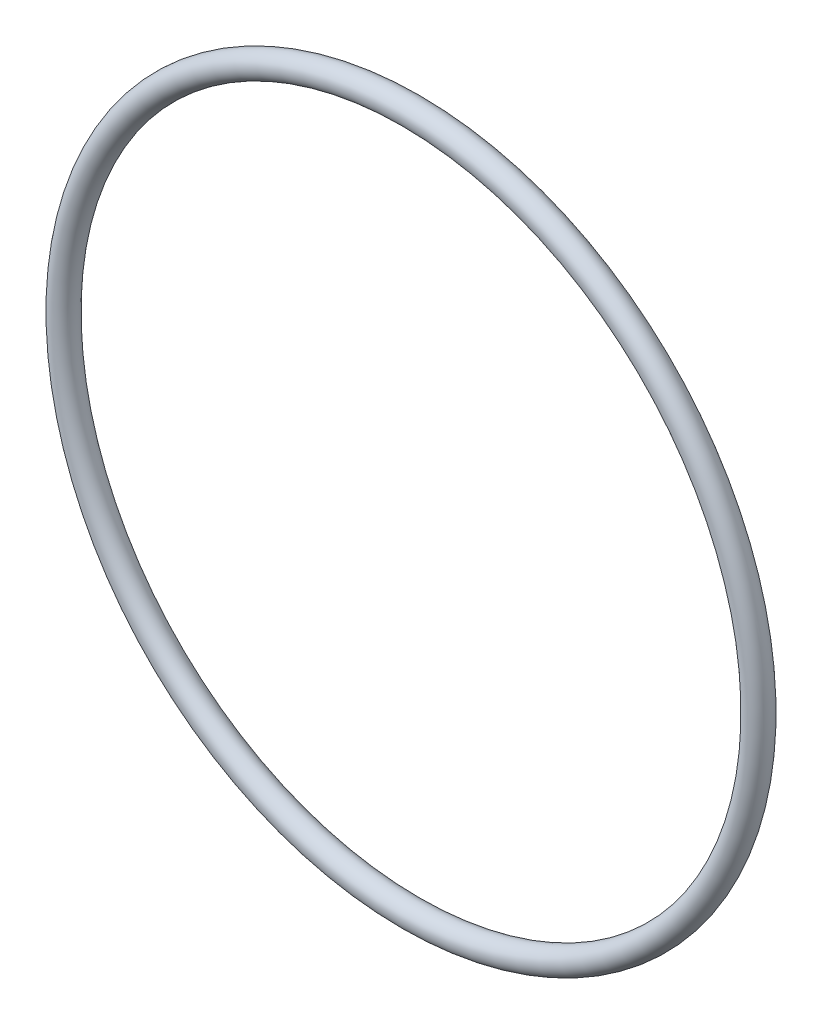
ISO-10303-21;
HEADER;
FILE_DESCRIPTION(('STEP AP214'),'2;1');
FILE_NAME('part.step','',(''),(''),'','','');
FILE_SCHEMA(('AUTOMOTIVE_DESIGN { 1 0 10303 214 1 1 1 1 }'));
ENDSEC;
DATA;
#1=APPLICATION_CONTEXT('core data for automotive mechanical design processes');
#2=APPLICATION_PROTOCOL_DEFINITION('international standard','automotive_design',2000,#1);
#3=PRODUCT_CONTEXT('',#1,'mechanical');
#4=PRODUCT('Part','Part','',(#3));
#5=PRODUCT_RELATED_PRODUCT_CATEGORY('part','',(#4));
#6=PRODUCT_DEFINITION_FORMATION('','',#4);
#7=PRODUCT_DEFINITION_CONTEXT('part definition',#1,'design');
#8=PRODUCT_DEFINITION('design','',#6,#7);
#9=PRODUCT_DEFINITION_SHAPE('','',#8);
#10=(LENGTH_UNIT() NAMED_UNIT(*) SI_UNIT(.MILLI.,.METRE.));
#11=(NAMED_UNIT(*) PLANE_ANGLE_UNIT() SI_UNIT($,.RADIAN.));
#12=(NAMED_UNIT(*) SI_UNIT($,.STERADIAN.) SOLID_ANGLE_UNIT());
#13=UNCERTAINTY_MEASURE_WITH_UNIT(LENGTH_MEASURE(1.E-05),#10,'distance_accuracy_value','');
#14=(GEOMETRIC_REPRESENTATION_CONTEXT(3) GLOBAL_UNCERTAINTY_ASSIGNED_CONTEXT((#13)) GLOBAL_UNIT_ASSIGNED_CONTEXT((#10,
#11,#12)) REPRESENTATION_CONTEXT('',''));
#15=CARTESIAN_POINT('',(0.,0.,0.));
#16=DIRECTION('',(0.,0.,1.));
#17=DIRECTION('',(1.,0.,0.));
#18=AXIS2_PLACEMENT_3D('',#15,#16,#17);
#19=CARTESIAN_POINT('',(0.,0.,1.5));
#20=DIRECTION('',(0.,0.,-1.));
#21=DIRECTION('',(0.,1.,0.));
#22=AXIS2_PLACEMENT_3D('',#19,#20,#21);
#23=TOROIDAL_SURFACE('',#22,1.4,0.0499999999999999);
#24=CARTESIAN_POINT('',(0.,1.45,1.5));
#25=VERTEX_POINT('',#24);
#26=VERTEX_LOOP('',#25);
#27=FACE_BOUND('',#26,.T.);
#28=ADVANCED_FACE('F13',(#27),#23,.T.);
#29=CLOSED_SHELL('',(#28));
#30=MANIFOLD_SOLID_BREP('B1',#29);
#31=ADVANCED_BREP_SHAPE_REPRESENTATION('',(#18,#30),#14);
#32=SHAPE_DEFINITION_REPRESENTATION(#9,#31);
ENDSEC;
END-ISO-10303-21;
